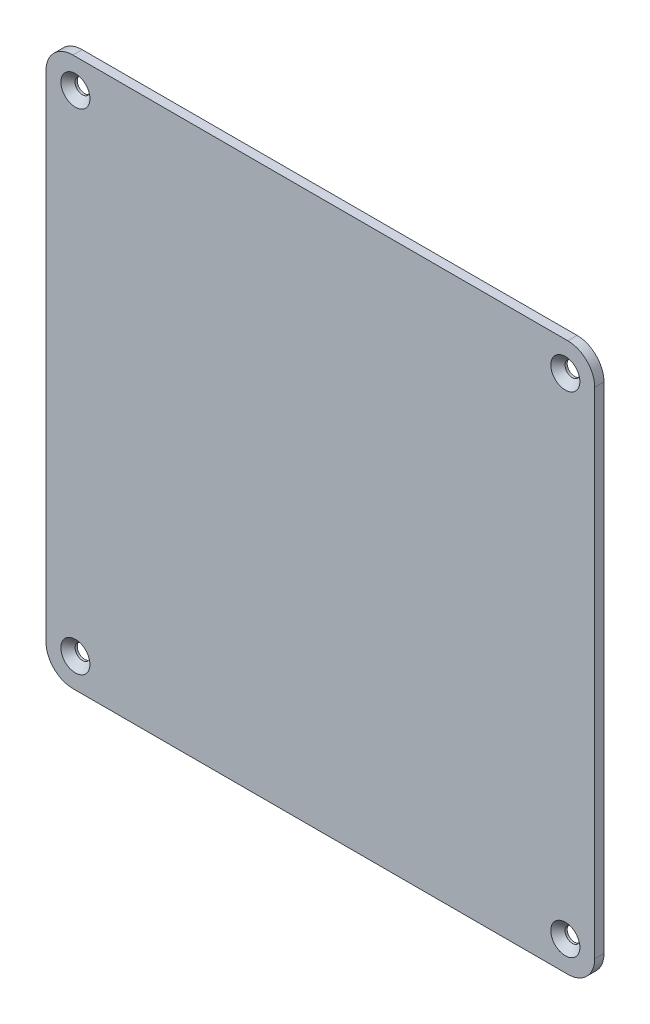
ISO-10303-21;
HEADER;
FILE_DESCRIPTION(('STEP AP214'),'2;1');
FILE_NAME('part.step','',(''),(''),'','','');
FILE_SCHEMA(('AUTOMOTIVE_DESIGN { 1 0 10303 214 1 1 1 1 }'));
ENDSEC;
DATA;
#1=APPLICATION_CONTEXT('core data for automotive mechanical design processes');
#2=APPLICATION_PROTOCOL_DEFINITION('international standard','automotive_design',2000,#1);
#3=PRODUCT_CONTEXT('',#1,'mechanical');
#4=PRODUCT('Part','Part','',(#3));
#5=PRODUCT_RELATED_PRODUCT_CATEGORY('part','',(#4));
#6=PRODUCT_DEFINITION_FORMATION('','',#4);
#7=PRODUCT_DEFINITION_CONTEXT('part definition',#1,'design');
#8=PRODUCT_DEFINITION('design','',#6,#7);
#9=PRODUCT_DEFINITION_SHAPE('','',#8);
#10=(LENGTH_UNIT() NAMED_UNIT(*) SI_UNIT(.MILLI.,.METRE.));
#11=(NAMED_UNIT(*) PLANE_ANGLE_UNIT() SI_UNIT($,.RADIAN.));
#12=(NAMED_UNIT(*) SI_UNIT($,.STERADIAN.) SOLID_ANGLE_UNIT());
#13=UNCERTAINTY_MEASURE_WITH_UNIT(LENGTH_MEASURE(1.E-05),#10,'distance_accuracy_value','');
#14=(GEOMETRIC_REPRESENTATION_CONTEXT(3) GLOBAL_UNCERTAINTY_ASSIGNED_CONTEXT((#13)) GLOBAL_UNIT_ASSIGNED_CONTEXT((#10,
#11,#12)) REPRESENTATION_CONTEXT('',''));
#15=CARTESIAN_POINT('',(0.,0.,0.));
#16=DIRECTION('',(0.,0.,1.));
#17=DIRECTION('',(1.,0.,0.));
#18=AXIS2_PLACEMENT_3D('',#15,#16,#17);
#19=CARTESIAN_POINT('',(-80.,80.,-3.));
#20=DIRECTION('',(0.,0.,1.));
#21=DIRECTION('',(1.,0.,0.));
#22=AXIS2_PLACEMENT_3D('',#19,#20,#21);
#23=CYLINDRICAL_SURFACE('',#22,8.70000000000002);
#24=CARTESIAN_POINT('',(-80.,80.,0.));
#25=DIRECTION('',(0.,0.,1.));
#26=DIRECTION('',(1.,0.,0.));
#27=AXIS2_PLACEMENT_3D('',#24,#25,#26);
#28=CIRCLE('',#27,8.70000000000002);
#29=CARTESIAN_POINT('',(-80.,88.7,0.));
#30=VERTEX_POINT('',#29);
#31=CARTESIAN_POINT('',(-88.7,80.,0.));
#32=VERTEX_POINT('',#31);
#33=EDGE_CURVE('E130',#30,#32,#28,.T.);
#34=ORIENTED_EDGE('',*,*,#33,.F.);
#35=DIRECTION('',(0.,0.,1.));
#36=VECTOR('',#35,1.);
#37=CARTESIAN_POINT('',(-80.,88.7,-3.));
#38=LINE('',#37,#36);
#39=CARTESIAN_POINT('',(-80.,88.7,-3.));
#40=VERTEX_POINT('',#39);
#41=EDGE_CURVE('E11',#40,#30,#38,.T.);
#42=ORIENTED_EDGE('',*,*,#41,.F.);
#43=CARTESIAN_POINT('',(-80.,80.,-3.));
#44=DIRECTION('',(0.,0.,1.));
#45=DIRECTION('',(1.,0.,0.));
#46=AXIS2_PLACEMENT_3D('',#43,#44,#45);
#47=CIRCLE('',#46,8.70000000000002);
#48=CARTESIAN_POINT('',(-88.7,80.,-3.));
#49=VERTEX_POINT('',#48);
#50=EDGE_CURVE('E151',#40,#49,#47,.T.);
#51=ORIENTED_EDGE('',*,*,#50,.T.);
#52=DIRECTION('',(0.,0.,1.));
#53=VECTOR('',#52,1.);
#54=CARTESIAN_POINT('',(-88.7,80.,-3.));
#55=LINE('',#54,#53);
#56=EDGE_CURVE('E36',#49,#32,#55,.T.);
#57=ORIENTED_EDGE('',*,*,#56,.T.);
#58=EDGE_LOOP('',(#34,#42,#51,#57));
#59=FACE_BOUND('',#58,.T.);
#60=ADVANCED_FACE('F33',(#59),#23,.T.);
#61=CARTESIAN_POINT('',(80.,88.7,-3.));
#62=DIRECTION('',(0.,1.,0.));
#63=DIRECTION('',(-1.,0.,0.));
#64=AXIS2_PLACEMENT_3D('',#61,#62,#63);
#65=PLANE('',#64);
#66=DIRECTION('',(-1.,0.,0.));
#67=VECTOR('',#66,1.);
#68=CARTESIAN_POINT('',(80.,88.7,0.));
#69=LINE('',#68,#67);
#70=CARTESIAN_POINT('',(80.,88.7,0.));
#71=VERTEX_POINT('',#70);
#72=EDGE_CURVE('E149',#71,#30,#69,.T.);
#73=ORIENTED_EDGE('',*,*,#72,.F.);
#74=DIRECTION('',(0.,0.,1.));
#75=VECTOR('',#74,1.);
#76=CARTESIAN_POINT('',(80.,88.7,-3.));
#77=LINE('',#76,#75);
#78=CARTESIAN_POINT('',(80.,88.7,-3.));
#79=VERTEX_POINT('',#78);
#80=EDGE_CURVE('E42',#79,#71,#77,.T.);
#81=ORIENTED_EDGE('',*,*,#80,.F.);
#82=DIRECTION('',(-1.,0.,0.));
#83=VECTOR('',#82,1.);
#84=CARTESIAN_POINT('',(80.,88.7,-3.));
#85=LINE('',#84,#83);
#86=EDGE_CURVE('E120',#79,#40,#85,.T.);
#87=ORIENTED_EDGE('',*,*,#86,.T.);
#88=ORIENTED_EDGE('',*,*,#41,.T.);
#89=EDGE_LOOP('',(#73,#81,#87,#88));
#90=FACE_BOUND('',#89,.T.);
#91=ADVANCED_FACE('F163',(#90),#65,.T.);
#92=CARTESIAN_POINT('',(80.,80.,-3.));
#93=DIRECTION('',(0.,0.,1.));
#94=DIRECTION('',(1.,0.,0.));
#95=AXIS2_PLACEMENT_3D('',#92,#93,#94);
#96=CYLINDRICAL_SURFACE('',#95,8.70000000000001);
#97=CARTESIAN_POINT('',(80.,80.,0.));
#98=DIRECTION('',(0.,0.,1.));
#99=DIRECTION('',(1.,0.,0.));
#100=AXIS2_PLACEMENT_3D('',#97,#98,#99);
#101=CIRCLE('',#100,8.70000000000001);
#102=CARTESIAN_POINT('',(88.7,80.,0.));
#103=VERTEX_POINT('',#102);
#104=EDGE_CURVE('E107',#103,#71,#101,.T.);
#105=ORIENTED_EDGE('',*,*,#104,.F.);
#106=DIRECTION('',(0.,0.,1.));
#107=VECTOR('',#106,1.);
#108=CARTESIAN_POINT('',(88.7,80.,-3.));
#109=LINE('',#108,#107);
#110=CARTESIAN_POINT('',(88.7,80.,-3.));
#111=VERTEX_POINT('',#110);
#112=EDGE_CURVE('E102',#111,#103,#109,.T.);
#113=ORIENTED_EDGE('',*,*,#112,.F.);
#114=CARTESIAN_POINT('',(80.,80.,-3.));
#115=DIRECTION('',(0.,0.,1.));
#116=DIRECTION('',(1.,0.,0.));
#117=AXIS2_PLACEMENT_3D('',#114,#115,#116);
#118=CIRCLE('',#117,8.70000000000001);
#119=EDGE_CURVE('E105',#111,#79,#118,.T.);
#120=ORIENTED_EDGE('',*,*,#119,.T.);
#121=ORIENTED_EDGE('',*,*,#80,.T.);
#122=EDGE_LOOP('',(#105,#113,#120,#121));
#123=FACE_BOUND('',#122,.T.);
#124=ADVANCED_FACE('F104',(#123),#96,.T.);
#125=CARTESIAN_POINT('',(88.7,-80.,-3.));
#126=DIRECTION('',(1.,0.,0.));
#127=DIRECTION('',(0.,0.,-1.));
#128=AXIS2_PLACEMENT_3D('',#125,#126,#127);
#129=PLANE('',#128);
#130=DIRECTION('',(0.,1.,0.));
#131=VECTOR('',#130,1.);
#132=CARTESIAN_POINT('',(88.7,-80.,0.));
#133=LINE('',#132,#131);
#134=CARTESIAN_POINT('',(88.7,-80.,0.));
#135=VERTEX_POINT('',#134);
#136=EDGE_CURVE('E146',#135,#103,#133,.T.);
#137=ORIENTED_EDGE('',*,*,#136,.F.);
#138=DIRECTION('',(0.,0.,1.));
#139=VECTOR('',#138,1.);
#140=CARTESIAN_POINT('',(88.7,-80.,-3.));
#141=LINE('',#140,#139);
#142=CARTESIAN_POINT('',(88.7,-80.,-3.));
#143=VERTEX_POINT('',#142);
#144=EDGE_CURVE('E112',#143,#135,#141,.T.);
#145=ORIENTED_EDGE('',*,*,#144,.F.);
#146=DIRECTION('',(0.,1.,0.));
#147=VECTOR('',#146,1.);
#148=CARTESIAN_POINT('',(88.7,-80.,-3.));
#149=LINE('',#148,#147);
#150=EDGE_CURVE('E118',#143,#111,#149,.T.);
#151=ORIENTED_EDGE('',*,*,#150,.T.);
#152=ORIENTED_EDGE('',*,*,#112,.T.);
#153=EDGE_LOOP('',(#137,#145,#151,#152));
#154=FACE_BOUND('',#153,.T.);
#155=ADVANCED_FACE('F122',(#154),#129,.T.);
#156=CARTESIAN_POINT('',(80.,-80.,-3.));
#157=DIRECTION('',(0.,0.,1.));
#158=DIRECTION('',(1.,0.,0.));
#159=AXIS2_PLACEMENT_3D('',#156,#157,#158);
#160=CYLINDRICAL_SURFACE('',#159,8.70000000000001);
#161=CARTESIAN_POINT('',(80.,-80.,0.));
#162=DIRECTION('',(0.,0.,1.));
#163=DIRECTION('',(1.,0.,0.));
#164=AXIS2_PLACEMENT_3D('',#161,#162,#163);
#165=CIRCLE('',#164,8.70000000000001);
#166=CARTESIAN_POINT('',(80.,-88.7,0.));
#167=VERTEX_POINT('',#166);
#168=EDGE_CURVE('E143',#167,#135,#165,.T.);
#169=ORIENTED_EDGE('',*,*,#168,.F.);
#170=DIRECTION('',(0.,0.,1.));
#171=VECTOR('',#170,1.);
#172=CARTESIAN_POINT('',(80.,-88.7,-3.));
#173=LINE('',#172,#171);
#174=CARTESIAN_POINT('',(80.,-88.7,-3.));
#175=VERTEX_POINT('',#174);
#176=EDGE_CURVE('E155',#175,#167,#173,.T.);
#177=ORIENTED_EDGE('',*,*,#176,.F.);
#178=CARTESIAN_POINT('',(80.,-80.,-3.));
#179=DIRECTION('',(0.,0.,1.));
#180=DIRECTION('',(1.,0.,0.));
#181=AXIS2_PLACEMENT_3D('',#178,#179,#180);
#182=CIRCLE('',#181,8.70000000000001);
#183=EDGE_CURVE('E123',#175,#143,#182,.T.);
#184=ORIENTED_EDGE('',*,*,#183,.T.);
#185=ORIENTED_EDGE('',*,*,#144,.T.);
#186=EDGE_LOOP('',(#169,#177,#184,#185));
#187=FACE_BOUND('',#186,.T.);
#188=ADVANCED_FACE('F176',(#187),#160,.T.);
#189=CARTESIAN_POINT('',(-80.,-88.7,-3.));
#190=DIRECTION('',(0.,-1.,0.));
#191=DIRECTION('',(0.,0.,-1.));
#192=AXIS2_PLACEMENT_3D('',#189,#190,#191);
#193=PLANE('',#192);
#194=DIRECTION('',(1.,0.,0.));
#195=VECTOR('',#194,1.);
#196=CARTESIAN_POINT('',(-80.,-88.7,0.));
#197=LINE('',#196,#195);
#198=CARTESIAN_POINT('',(-80.,-88.7,0.));
#199=VERTEX_POINT('',#198);
#200=EDGE_CURVE('E140',#199,#167,#197,.T.);
#201=ORIENTED_EDGE('',*,*,#200,.F.);
#202=DIRECTION('',(0.,0.,1.));
#203=VECTOR('',#202,1.);
#204=CARTESIAN_POINT('',(-80.,-88.7,-3.));
#205=LINE('',#204,#203);
#206=CARTESIAN_POINT('',(-80.,-88.7,-3.));
#207=VERTEX_POINT('',#206);
#208=EDGE_CURVE('E157',#207,#199,#205,.T.);
#209=ORIENTED_EDGE('',*,*,#208,.F.);
#210=DIRECTION('',(1.,0.,0.));
#211=VECTOR('',#210,1.);
#212=CARTESIAN_POINT('',(-80.,-88.7,-3.));
#213=LINE('',#212,#211);
#214=EDGE_CURVE('E125',#207,#175,#213,.T.);
#215=ORIENTED_EDGE('',*,*,#214,.T.);
#216=ORIENTED_EDGE('',*,*,#176,.T.);
#217=EDGE_LOOP('',(#201,#209,#215,#216));
#218=FACE_BOUND('',#217,.T.);
#219=ADVANCED_FACE('F179',(#218),#193,.T.);
#220=CARTESIAN_POINT('',(-80.,-80.,-3.));
#221=DIRECTION('',(0.,0.,1.));
#222=DIRECTION('',(1.,0.,0.));
#223=AXIS2_PLACEMENT_3D('',#220,#221,#222);
#224=CYLINDRICAL_SURFACE('',#223,8.70000000000001);
#225=CARTESIAN_POINT('',(-80.,-80.,0.));
#226=DIRECTION('',(0.,0.,1.));
#227=DIRECTION('',(1.,0.,0.));
#228=AXIS2_PLACEMENT_3D('',#225,#226,#227);
#229=CIRCLE('',#228,8.70000000000001);
#230=CARTESIAN_POINT('',(-88.7,-80.,0.));
#231=VERTEX_POINT('',#230);
#232=EDGE_CURVE('E137',#231,#199,#229,.T.);
#233=ORIENTED_EDGE('',*,*,#232,.F.);
#234=DIRECTION('',(0.,0.,1.));
#235=VECTOR('',#234,1.);
#236=CARTESIAN_POINT('',(-88.7,-80.,-3.));
#237=LINE('',#236,#235);
#238=CARTESIAN_POINT('',(-88.7,-80.,-3.));
#239=VERTEX_POINT('',#238);
#240=EDGE_CURVE('E158',#239,#231,#237,.T.);
#241=ORIENTED_EDGE('',*,*,#240,.F.);
#242=CARTESIAN_POINT('',(-80.,-80.,-3.));
#243=DIRECTION('',(0.,0.,1.));
#244=DIRECTION('',(1.,0.,0.));
#245=AXIS2_PLACEMENT_3D('',#242,#243,#244);
#246=CIRCLE('',#245,8.70000000000001);
#247=EDGE_CURVE('E273',#239,#207,#246,.T.);
#248=ORIENTED_EDGE('',*,*,#247,.T.);
#249=ORIENTED_EDGE('',*,*,#208,.T.);
#250=EDGE_LOOP('',(#233,#241,#248,#249));
#251=FACE_BOUND('',#250,.T.);
#252=ADVANCED_FACE('F183',(#251),#224,.T.);
#253=CARTESIAN_POINT('',(-88.7,80.,-3.));
#254=DIRECTION('',(-1.,0.,0.));
#255=DIRECTION('',(0.,-1.,0.));
#256=AXIS2_PLACEMENT_3D('',#253,#254,#255);
#257=PLANE('',#256);
#258=DIRECTION('',(0.,-1.,0.));
#259=VECTOR('',#258,1.);
#260=CARTESIAN_POINT('',(-88.7,80.,0.));
#261=LINE('',#260,#259);
#262=EDGE_CURVE('E133',#32,#231,#261,.T.);
#263=ORIENTED_EDGE('',*,*,#262,.F.);
#264=ORIENTED_EDGE('',*,*,#56,.F.);
#265=DIRECTION('',(0.,-1.,0.));
#266=VECTOR('',#265,1.);
#267=CARTESIAN_POINT('',(-88.7,80.,-3.));
#268=LINE('',#267,#266);
#269=EDGE_CURVE('E271',#49,#239,#268,.T.);
#270=ORIENTED_EDGE('',*,*,#269,.T.);
#271=ORIENTED_EDGE('',*,*,#240,.T.);
#272=EDGE_LOOP('',(#263,#264,#270,#271));
#273=FACE_BOUND('',#272,.T.);
#274=ADVANCED_FACE('F160',(#273),#257,.T.);
#275=CARTESIAN_POINT('',(-80.,80.,-3.));
#276=DIRECTION('',(0.,0.,1.));
#277=DIRECTION('',(1.,0.,0.));
#278=AXIS2_PLACEMENT_3D('',#275,#276,#277);
#279=PLANE('',#278);
#280=CARTESIAN_POINT('',(-79.2,79.2,-3.));
#281=DIRECTION('',(0.,0.,1.));
#282=DIRECTION('',(1.,0.,0.));
#283=AXIS2_PLACEMENT_3D('',#280,#281,#282);
#284=CIRCLE('',#283,2.4);
#285=CARTESIAN_POINT('',(-76.8,79.2,-3.));
#286=VERTEX_POINT('',#285);
#287=EDGE_CURVE('E240',#286,#286,#284,.T.);
#288=ORIENTED_EDGE('',*,*,#287,.T.);
#289=EDGE_LOOP('',(#288));
#290=FACE_BOUND('',#289,.T.);
#291=CARTESIAN_POINT('',(79.2,79.2,-3.));
#292=DIRECTION('',(0.,0.,1.));
#293=DIRECTION('',(1.,0.,0.));
#294=AXIS2_PLACEMENT_3D('',#291,#292,#293);
#295=CIRCLE('',#294,2.4);
#296=CARTESIAN_POINT('',(81.6000000000001,79.2,-3.));
#297=VERTEX_POINT('',#296);
#298=EDGE_CURVE('E250',#297,#297,#295,.T.);
#299=ORIENTED_EDGE('',*,*,#298,.T.);
#300=EDGE_LOOP('',(#299));
#301=FACE_BOUND('',#300,.T.);
#302=CARTESIAN_POINT('',(79.2000000000001,-79.2,-3.));
#303=DIRECTION('',(0.,0.,1.));
#304=DIRECTION('',(1.,0.,0.));
#305=AXIS2_PLACEMENT_3D('',#302,#303,#304);
#306=CIRCLE('',#305,2.4);
#307=CARTESIAN_POINT('',(81.6000000000001,-79.2,-3.));
#308=VERTEX_POINT('',#307);
#309=EDGE_CURVE('E259',#308,#308,#306,.T.);
#310=ORIENTED_EDGE('',*,*,#309,.T.);
#311=EDGE_LOOP('',(#310));
#312=FACE_BOUND('',#311,.T.);
#313=CARTESIAN_POINT('',(-79.2,-79.2,-3.));
#314=DIRECTION('',(0.,0.,1.));
#315=DIRECTION('',(1.,0.,0.));
#316=AXIS2_PLACEMENT_3D('',#313,#314,#315);
#317=CIRCLE('',#316,2.4);
#318=CARTESIAN_POINT('',(-76.8,-79.2,-3.));
#319=VERTEX_POINT('',#318);
#320=EDGE_CURVE('E134',#319,#319,#317,.T.);
#321=ORIENTED_EDGE('',*,*,#320,.T.);
#322=EDGE_LOOP('',(#321));
#323=FACE_BOUND('',#322,.T.);
#324=ORIENTED_EDGE('',*,*,#50,.F.);
#325=ORIENTED_EDGE('',*,*,#86,.F.);
#326=ORIENTED_EDGE('',*,*,#119,.F.);
#327=ORIENTED_EDGE('',*,*,#150,.F.);
#328=ORIENTED_EDGE('',*,*,#183,.F.);
#329=ORIENTED_EDGE('',*,*,#214,.F.);
#330=ORIENTED_EDGE('',*,*,#247,.F.);
#331=ORIENTED_EDGE('',*,*,#269,.F.);
#332=EDGE_LOOP('',(#324,#325,#326,#327,#328,#329,#330,#331));
#333=FACE_BOUND('',#332,.T.);
#334=ADVANCED_FACE('F116',(#290,#301,#312,#323,#333),#279,.F.);
#335=CARTESIAN_POINT('',(-80.,80.,0.));
#336=DIRECTION('',(0.,0.,1.));
#337=DIRECTION('',(1.,0.,0.));
#338=AXIS2_PLACEMENT_3D('',#335,#336,#337);
#339=PLANE('',#338);
#340=CARTESIAN_POINT('',(-79.2,79.2,0.));
#341=DIRECTION('',(0.,0.,1.));
#342=DIRECTION('',(1.,0.,0.));
#343=AXIS2_PLACEMENT_3D('',#340,#341,#342);
#344=CIRCLE('',#343,4.7);
#345=CARTESIAN_POINT('',(-74.5,79.2,0.));
#346=VERTEX_POINT('',#345);
#347=EDGE_CURVE('E238',#346,#346,#344,.T.);
#348=ORIENTED_EDGE('',*,*,#347,.F.);
#349=EDGE_LOOP('',(#348));
#350=FACE_BOUND('',#349,.T.);
#351=CARTESIAN_POINT('',(79.2,79.2,0.));
#352=DIRECTION('',(0.,0.,1.));
#353=DIRECTION('',(1.,0.,0.));
#354=AXIS2_PLACEMENT_3D('',#351,#352,#353);
#355=CIRCLE('',#354,4.7);
#356=CARTESIAN_POINT('',(83.9,79.2,0.));
#357=VERTEX_POINT('',#356);
#358=EDGE_CURVE('E244',#357,#357,#355,.T.);
#359=ORIENTED_EDGE('',*,*,#358,.F.);
#360=EDGE_LOOP('',(#359));
#361=FACE_BOUND('',#360,.T.);
#362=CARTESIAN_POINT('',(79.2000000000001,-79.2,0.));
#363=DIRECTION('',(0.,0.,1.));
#364=DIRECTION('',(1.,0.,0.));
#365=AXIS2_PLACEMENT_3D('',#362,#363,#364);
#366=CIRCLE('',#365,4.7);
#367=CARTESIAN_POINT('',(83.9000000000001,-79.2,0.));
#368=VERTEX_POINT('',#367);
#369=EDGE_CURVE('E253',#368,#368,#366,.T.);
#370=ORIENTED_EDGE('',*,*,#369,.F.);
#371=EDGE_LOOP('',(#370));
#372=FACE_BOUND('',#371,.T.);
#373=CARTESIAN_POINT('',(-79.2,-79.2,0.));
#374=DIRECTION('',(0.,0.,1.));
#375=DIRECTION('',(1.,0.,0.));
#376=AXIS2_PLACEMENT_3D('',#373,#374,#375);
#377=CIRCLE('',#376,4.7);
#378=CARTESIAN_POINT('',(-74.5,-79.2,0.));
#379=VERTEX_POINT('',#378);
#380=EDGE_CURVE('E262',#379,#379,#377,.T.);
#381=ORIENTED_EDGE('',*,*,#380,.F.);
#382=EDGE_LOOP('',(#381));
#383=FACE_BOUND('',#382,.T.);
#384=ORIENTED_EDGE('',*,*,#33,.T.);
#385=ORIENTED_EDGE('',*,*,#262,.T.);
#386=ORIENTED_EDGE('',*,*,#232,.T.);
#387=ORIENTED_EDGE('',*,*,#200,.T.);
#388=ORIENTED_EDGE('',*,*,#168,.T.);
#389=ORIENTED_EDGE('',*,*,#136,.T.);
#390=ORIENTED_EDGE('',*,*,#104,.T.);
#391=ORIENTED_EDGE('',*,*,#72,.T.);
#392=EDGE_LOOP('',(#384,#385,#386,#387,#388,#389,#390,#391));
#393=FACE_BOUND('',#392,.T.);
#394=ADVANCED_FACE('F162',(#350,#361,#372,#383,#393),#339,.T.);
#395=CARTESIAN_POINT('',(-79.2,-79.2,0.));
#396=DIRECTION('',(0.,0.,1.));
#397=DIRECTION('',(1.,0.,0.));
#398=AXIS2_PLACEMENT_3D('',#395,#396,#397);
#399=CYLINDRICAL_SURFACE('',#398,2.4);
#400=ORIENTED_EDGE('',*,*,#320,.F.);
#401=EDGE_LOOP('',(#400));
#402=FACE_BOUND('',#401,.T.);
#403=CARTESIAN_POINT('',(-79.2,-79.2,-2.3));
#404=DIRECTION('',(0.,0.,1.));
#405=DIRECTION('',(1.,0.,0.));
#406=AXIS2_PLACEMENT_3D('',#403,#404,#405);
#407=CIRCLE('',#406,2.4);
#408=CARTESIAN_POINT('',(-76.8,-79.2,-2.3));
#409=VERTEX_POINT('',#408);
#410=EDGE_CURVE('E265',#409,#409,#407,.T.);
#411=ORIENTED_EDGE('',*,*,#410,.T.);
#412=EDGE_LOOP('',(#411));
#413=FACE_BOUND('',#412,.T.);
#414=ADVANCED_FACE('F195',(#402,#413),#399,.F.);
#415=CARTESIAN_POINT('',(-79.2,-79.2,0.));
#416=DIRECTION('',(0.,0.,1.));
#417=DIRECTION('',(1.,0.,0.));
#418=AXIS2_PLACEMENT_3D('',#415,#416,#417);
#419=CONICAL_SURFACE('',#418,4.7,0.785398163397447);
#420=ORIENTED_EDGE('',*,*,#410,.F.);
#421=EDGE_LOOP('',(#420));
#422=FACE_BOUND('',#421,.T.);
#423=ORIENTED_EDGE('',*,*,#380,.T.);
#424=EDGE_LOOP('',(#423));
#425=FACE_BOUND('',#424,.T.);
#426=ADVANCED_FACE('F202',(#422,#425),#419,.F.);
#427=CARTESIAN_POINT('',(79.2000000000001,-79.2,0.));
#428=DIRECTION('',(0.,0.,1.));
#429=DIRECTION('',(1.,0.,0.));
#430=AXIS2_PLACEMENT_3D('',#427,#428,#429);
#431=CYLINDRICAL_SURFACE('',#430,2.4);
#432=ORIENTED_EDGE('',*,*,#309,.F.);
#433=EDGE_LOOP('',(#432));
#434=FACE_BOUND('',#433,.T.);
#435=CARTESIAN_POINT('',(79.2000000000001,-79.2,-2.3));
#436=DIRECTION('',(0.,0.,1.));
#437=DIRECTION('',(1.,0.,0.));
#438=AXIS2_PLACEMENT_3D('',#435,#436,#437);
#439=CIRCLE('',#438,2.4);
#440=CARTESIAN_POINT('',(81.6000000000001,-79.2,-2.3));
#441=VERTEX_POINT('',#440);
#442=EDGE_CURVE('E256',#441,#441,#439,.T.);
#443=ORIENTED_EDGE('',*,*,#442,.T.);
#444=EDGE_LOOP('',(#443));
#445=FACE_BOUND('',#444,.T.);
#446=ADVANCED_FACE('F206',(#434,#445),#431,.F.);
#447=CARTESIAN_POINT('',(79.2000000000001,-79.2,0.));
#448=DIRECTION('',(0.,0.,1.));
#449=DIRECTION('',(1.,0.,0.));
#450=AXIS2_PLACEMENT_3D('',#447,#448,#449);
#451=CONICAL_SURFACE('',#450,4.7,0.785398163397447);
#452=ORIENTED_EDGE('',*,*,#442,.F.);
#453=EDGE_LOOP('',(#452));
#454=FACE_BOUND('',#453,.T.);
#455=ORIENTED_EDGE('',*,*,#369,.T.);
#456=EDGE_LOOP('',(#455));
#457=FACE_BOUND('',#456,.T.);
#458=ADVANCED_FACE('F210',(#454,#457),#451,.F.);
#459=CARTESIAN_POINT('',(79.2,79.2,0.));
#460=DIRECTION('',(0.,0.,1.));
#461=DIRECTION('',(1.,0.,0.));
#462=AXIS2_PLACEMENT_3D('',#459,#460,#461);
#463=CYLINDRICAL_SURFACE('',#462,2.4);
#464=ORIENTED_EDGE('',*,*,#298,.F.);
#465=EDGE_LOOP('',(#464));
#466=FACE_BOUND('',#465,.T.);
#467=CARTESIAN_POINT('',(79.2,79.2,-2.3));
#468=DIRECTION('',(0.,0.,1.));
#469=DIRECTION('',(1.,0.,0.));
#470=AXIS2_PLACEMENT_3D('',#467,#468,#469);
#471=CIRCLE('',#470,2.4);
#472=CARTESIAN_POINT('',(81.6000000000001,79.2,-2.3));
#473=VERTEX_POINT('',#472);
#474=EDGE_CURVE('E247',#473,#473,#471,.T.);
#475=ORIENTED_EDGE('',*,*,#474,.T.);
#476=EDGE_LOOP('',(#475));
#477=FACE_BOUND('',#476,.T.);
#478=ADVANCED_FACE('F214',(#466,#477),#463,.F.);
#479=CARTESIAN_POINT('',(79.2,79.2,0.));
#480=DIRECTION('',(0.,0.,1.));
#481=DIRECTION('',(1.,0.,0.));
#482=AXIS2_PLACEMENT_3D('',#479,#480,#481);
#483=CONICAL_SURFACE('',#482,4.7,0.785398163397447);
#484=ORIENTED_EDGE('',*,*,#474,.F.);
#485=EDGE_LOOP('',(#484));
#486=FACE_BOUND('',#485,.T.);
#487=ORIENTED_EDGE('',*,*,#358,.T.);
#488=EDGE_LOOP('',(#487));
#489=FACE_BOUND('',#488,.T.);
#490=ADVANCED_FACE('F218',(#486,#489),#483,.F.);
#491=CARTESIAN_POINT('',(-79.2,79.2,0.));
#492=DIRECTION('',(0.,0.,1.));
#493=DIRECTION('',(1.,0.,0.));
#494=AXIS2_PLACEMENT_3D('',#491,#492,#493);
#495=CYLINDRICAL_SURFACE('',#494,2.4);
#496=ORIENTED_EDGE('',*,*,#287,.F.);
#497=EDGE_LOOP('',(#496));
#498=FACE_BOUND('',#497,.T.);
#499=CARTESIAN_POINT('',(-79.2,79.2,-2.3));
#500=DIRECTION('',(0.,0.,1.));
#501=DIRECTION('',(1.,0.,0.));
#502=AXIS2_PLACEMENT_3D('',#499,#500,#501);
#503=CIRCLE('',#502,2.4);
#504=CARTESIAN_POINT('',(-76.8,79.2,-2.3));
#505=VERTEX_POINT('',#504);
#506=EDGE_CURVE('E235',#505,#505,#503,.T.);
#507=ORIENTED_EDGE('',*,*,#506,.T.);
#508=EDGE_LOOP('',(#507));
#509=FACE_BOUND('',#508,.T.);
#510=ADVANCED_FACE('F222',(#498,#509),#495,.F.);
#511=CARTESIAN_POINT('',(-79.2,79.2,0.));
#512=DIRECTION('',(0.,0.,1.));
#513=DIRECTION('',(1.,0.,0.));
#514=AXIS2_PLACEMENT_3D('',#511,#512,#513);
#515=CONICAL_SURFACE('',#514,4.7,0.785398163397447);
#516=ORIENTED_EDGE('',*,*,#506,.F.);
#517=EDGE_LOOP('',(#516));
#518=FACE_BOUND('',#517,.T.);
#519=ORIENTED_EDGE('',*,*,#347,.T.);
#520=EDGE_LOOP('',(#519));
#521=FACE_BOUND('',#520,.T.);
#522=ADVANCED_FACE('F226',(#518,#521),#515,.F.);
#523=CLOSED_SHELL('',(#60,#91,#124,#155,#188,#219,#252,#274,#334,#394,#414,#426,#446,#458,#478,
#490,#510,#522));
#524=MANIFOLD_SOLID_BREP('B2',#523);
#525=ADVANCED_BREP_SHAPE_REPRESENTATION('',(#18,#524),#14);
#526=SHAPE_DEFINITION_REPRESENTATION(#9,#525);
ENDSEC;
END-ISO-10303-21;
